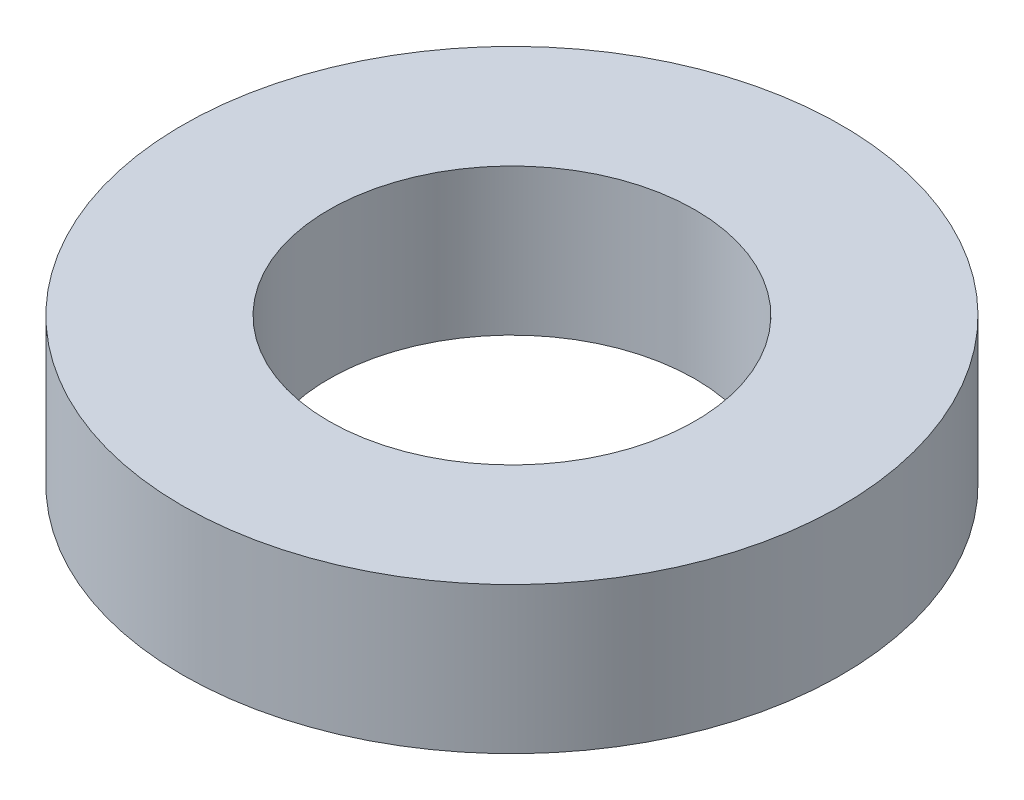
ISO-10303-21;
HEADER;
FILE_DESCRIPTION(('STEP AP214'),'2;1');
FILE_NAME('part.step','',(''),(''),'','','');
FILE_SCHEMA(('AUTOMOTIVE_DESIGN { 1 0 10303 214 1 1 1 1 }'));
ENDSEC;
DATA;
#1=APPLICATION_CONTEXT('core data for automotive mechanical design processes');
#2=APPLICATION_PROTOCOL_DEFINITION('international standard','automotive_design',2000,#1);
#3=PRODUCT_CONTEXT('',#1,'mechanical');
#4=PRODUCT('Part','Part','',(#3));
#5=PRODUCT_RELATED_PRODUCT_CATEGORY('part','',(#4));
#6=PRODUCT_DEFINITION_FORMATION('','',#4);
#7=PRODUCT_DEFINITION_CONTEXT('part definition',#1,'design');
#8=PRODUCT_DEFINITION('design','',#6,#7);
#9=PRODUCT_DEFINITION_SHAPE('','',#8);
#10=(LENGTH_UNIT() NAMED_UNIT(*) SI_UNIT(.MILLI.,.METRE.));
#11=(NAMED_UNIT(*) PLANE_ANGLE_UNIT() SI_UNIT($,.RADIAN.));
#12=(NAMED_UNIT(*) SI_UNIT($,.STERADIAN.) SOLID_ANGLE_UNIT());
#13=UNCERTAINTY_MEASURE_WITH_UNIT(LENGTH_MEASURE(1.E-05),#10,'distance_accuracy_value','');
#14=(GEOMETRIC_REPRESENTATION_CONTEXT(3) GLOBAL_UNCERTAINTY_ASSIGNED_CONTEXT((#13)) GLOBAL_UNIT_ASSIGNED_CONTEXT((#10,
#11,#12)) REPRESENTATION_CONTEXT('',''));
#15=CARTESIAN_POINT('',(0.,0.,0.));
#16=DIRECTION('',(0.,0.,1.));
#17=DIRECTION('',(1.,0.,0.));
#18=AXIS2_PLACEMENT_3D('',#15,#16,#17);
#19=CARTESIAN_POINT('',(0.,30.,0.));
#20=DIRECTION('',(0.,-1.,0.));
#21=DIRECTION('',(0.,0.,-1.));
#22=AXIS2_PLACEMENT_3D('',#19,#20,#21);
#23=CYLINDRICAL_SURFACE('',#22,67.5);
#24=CARTESIAN_POINT('',(0.,30.,0.));
#25=DIRECTION('',(0.,1.,0.));
#26=DIRECTION('',(0.,0.,1.));
#27=AXIS2_PLACEMENT_3D('',#24,#25,#26);
#28=CIRCLE('',#27,67.5);
#29=CARTESIAN_POINT('',(0.,30.,67.5));
#30=VERTEX_POINT('',#29);
#31=EDGE_CURVE('E10',#30,#30,#28,.T.);
#32=ORIENTED_EDGE('',*,*,#31,.F.);
#33=EDGE_LOOP('',(#32));
#34=FACE_BOUND('',#33,.T.);
#35=CARTESIAN_POINT('',(0.,0.,0.));
#36=DIRECTION('',(0.,1.,0.));
#37=DIRECTION('',(0.,0.,1.));
#38=AXIS2_PLACEMENT_3D('',#35,#36,#37);
#39=CIRCLE('',#38,67.5);
#40=CARTESIAN_POINT('',(0.,0.,67.5));
#41=VERTEX_POINT('',#40);
#42=EDGE_CURVE('E37',#41,#41,#39,.T.);
#43=ORIENTED_EDGE('',*,*,#42,.T.);
#44=EDGE_LOOP('',(#43));
#45=FACE_BOUND('',#44,.T.);
#46=ADVANCED_FACE('F40',(#34,#45),#23,.T.);
#47=CARTESIAN_POINT('',(0.,30.,0.));
#48=DIRECTION('',(0.,1.,0.));
#49=DIRECTION('',(0.,0.,1.));
#50=AXIS2_PLACEMENT_3D('',#47,#48,#49);
#51=PLANE('',#50);
#52=CARTESIAN_POINT('',(0.,30.,0.));
#53=DIRECTION('',(0.,1.,0.));
#54=DIRECTION('',(0.,0.,1.));
#55=AXIS2_PLACEMENT_3D('',#52,#53,#54);
#56=CIRCLE('',#55,37.5);
#57=CARTESIAN_POINT('',(0.,30.,37.5));
#58=VERTEX_POINT('',#57);
#59=EDGE_CURVE('E50',#58,#58,#56,.T.);
#60=ORIENTED_EDGE('',*,*,#59,.F.);
#61=EDGE_LOOP('',(#60));
#62=FACE_BOUND('',#61,.T.);
#63=ORIENTED_EDGE('',*,*,#31,.T.);
#64=EDGE_LOOP('',(#63));
#65=FACE_BOUND('',#64,.T.);
#66=ADVANCED_FACE('F59',(#62,#65),#51,.T.);
#67=CARTESIAN_POINT('',(0.,0.,0.));
#68=DIRECTION('',(0.,1.,0.));
#69=DIRECTION('',(0.,0.,1.));
#70=AXIS2_PLACEMENT_3D('',#67,#68,#69);
#71=PLANE('',#70);
#72=CARTESIAN_POINT('',(0.,0.,0.));
#73=DIRECTION('',(0.,1.,0.));
#74=DIRECTION('',(0.,0.,1.));
#75=AXIS2_PLACEMENT_3D('',#72,#73,#74);
#76=CIRCLE('',#75,37.5);
#77=CARTESIAN_POINT('',(0.,0.,37.5));
#78=VERTEX_POINT('',#77);
#79=EDGE_CURVE('E47',#78,#78,#76,.T.);
#80=ORIENTED_EDGE('',*,*,#79,.T.);
#81=EDGE_LOOP('',(#80));
#82=FACE_BOUND('',#81,.T.);
#83=ORIENTED_EDGE('',*,*,#42,.F.);
#84=EDGE_LOOP('',(#83));
#85=FACE_BOUND('',#84,.T.);
#86=ADVANCED_FACE('F58',(#82,#85),#71,.F.);
#87=CARTESIAN_POINT('',(0.,30.,0.));
#88=DIRECTION('',(0.,-1.,0.));
#89=DIRECTION('',(0.,0.,-1.));
#90=AXIS2_PLACEMENT_3D('',#87,#88,#89);
#91=CYLINDRICAL_SURFACE('',#90,37.5);
#92=ORIENTED_EDGE('',*,*,#59,.T.);
#93=EDGE_LOOP('',(#92));
#94=FACE_BOUND('',#93,.T.);
#95=ORIENTED_EDGE('',*,*,#79,.F.);
#96=EDGE_LOOP('',(#95));
#97=FACE_BOUND('',#96,.T.);
#98=ADVANCED_FACE('F54',(#94,#97),#91,.F.);
#99=CLOSED_SHELL('',(#46,#66,#86,#98));
#100=MANIFOLD_SOLID_BREP('B2',#99);
#101=ADVANCED_BREP_SHAPE_REPRESENTATION('',(#18,#100),#14);
#102=SHAPE_DEFINITION_REPRESENTATION(#9,#101);
ENDSEC;
END-ISO-10303-21;
